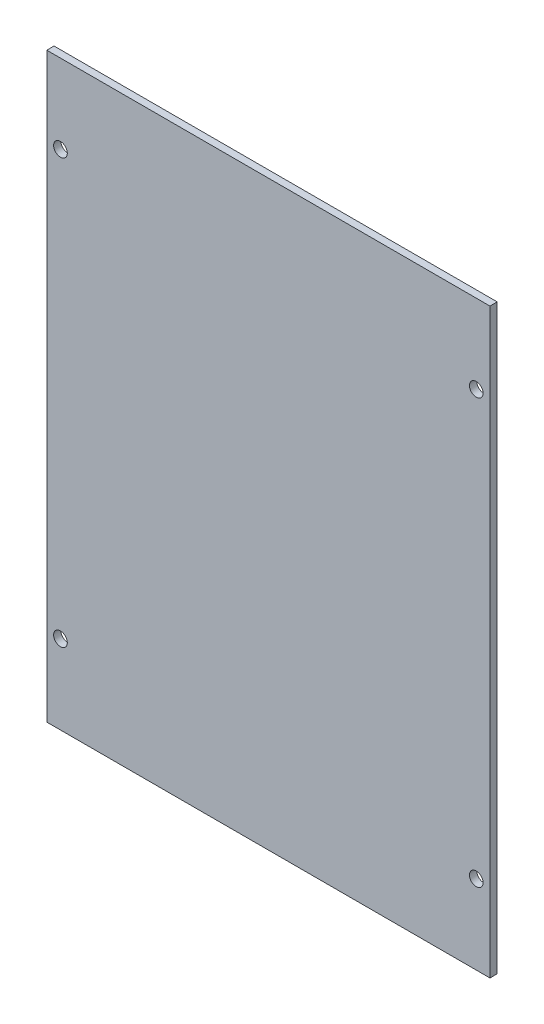
ISO-10303-21;
HEADER;
FILE_DESCRIPTION(('STEP AP214'),'2;1');
FILE_NAME('part.step','',(''),(''),'','','');
FILE_SCHEMA(('AUTOMOTIVE_DESIGN { 1 0 10303 214 1 1 1 1 }'));
ENDSEC;
DATA;
#1=APPLICATION_CONTEXT('core data for automotive mechanical design processes');
#2=APPLICATION_PROTOCOL_DEFINITION('international standard','automotive_design',2000,#1);
#3=PRODUCT_CONTEXT('',#1,'mechanical');
#4=PRODUCT('Part','Part','',(#3));
#5=PRODUCT_RELATED_PRODUCT_CATEGORY('part','',(#4));
#6=PRODUCT_DEFINITION_FORMATION('','',#4);
#7=PRODUCT_DEFINITION_CONTEXT('part definition',#1,'design');
#8=PRODUCT_DEFINITION('design','',#6,#7);
#9=PRODUCT_DEFINITION_SHAPE('','',#8);
#10=(LENGTH_UNIT() NAMED_UNIT(*) SI_UNIT(.MILLI.,.METRE.));
#11=(NAMED_UNIT(*) PLANE_ANGLE_UNIT() SI_UNIT($,.RADIAN.));
#12=(NAMED_UNIT(*) SI_UNIT($,.STERADIAN.) SOLID_ANGLE_UNIT());
#13=UNCERTAINTY_MEASURE_WITH_UNIT(LENGTH_MEASURE(1.E-05),#10,'distance_accuracy_value','');
#14=(GEOMETRIC_REPRESENTATION_CONTEXT(3) GLOBAL_UNCERTAINTY_ASSIGNED_CONTEXT((#13)) GLOBAL_UNIT_ASSIGNED_CONTEXT((#10,
#11,#12)) REPRESENTATION_CONTEXT('',''));
#15=CARTESIAN_POINT('',(0.,0.,0.));
#16=DIRECTION('',(0.,0.,1.));
#17=DIRECTION('',(1.,0.,0.));
#18=AXIS2_PLACEMENT_3D('',#15,#16,#17);
#19=CARTESIAN_POINT('',(-73.025,95.885,1.1938));
#20=DIRECTION('',(1.,0.,0.));
#21=DIRECTION('',(0.,0.,-1.));
#22=AXIS2_PLACEMENT_3D('',#19,#20,#21);
#23=PLANE('',#22);
#24=DIRECTION('',(0.,-1.,0.));
#25=VECTOR('',#24,1.);
#26=CARTESIAN_POINT('',(-73.025,95.885,-1.1938));
#27=LINE('',#26,#25);
#28=CARTESIAN_POINT('',(-73.025,95.885,-1.1938));
#29=VERTEX_POINT('',#28);
#30=CARTESIAN_POINT('',(-73.025,-95.885,-1.1938));
#31=VERTEX_POINT('',#30);
#32=EDGE_CURVE('E100',#29,#31,#27,.T.);
#33=ORIENTED_EDGE('',*,*,#32,.T.);
#34=DIRECTION('',(0.,0.,-1.));
#35=VECTOR('',#34,1.);
#36=CARTESIAN_POINT('',(-73.025,-95.885,1.1938));
#37=LINE('',#36,#35);
#38=CARTESIAN_POINT('',(-73.025,-95.885,1.1938));
#39=VERTEX_POINT('',#38);
#40=EDGE_CURVE('E11',#39,#31,#37,.T.);
#41=ORIENTED_EDGE('',*,*,#40,.F.);
#42=DIRECTION('',(0.,-1.,0.));
#43=VECTOR('',#42,1.);
#44=CARTESIAN_POINT('',(-73.025,95.885,1.1938));
#45=LINE('',#44,#43);
#46=CARTESIAN_POINT('',(-73.025,95.885,1.1938));
#47=VERTEX_POINT('',#46);
#48=EDGE_CURVE('E88',#47,#39,#45,.T.);
#49=ORIENTED_EDGE('',*,*,#48,.F.);
#50=DIRECTION('',(0.,0.,-1.));
#51=VECTOR('',#50,1.);
#52=CARTESIAN_POINT('',(-73.025,95.885,1.1938));
#53=LINE('',#52,#51);
#54=EDGE_CURVE('E96',#47,#29,#53,.T.);
#55=ORIENTED_EDGE('',*,*,#54,.T.);
#56=EDGE_LOOP('',(#33,#41,#49,#55));
#57=FACE_BOUND('',#56,.T.);
#58=ADVANCED_FACE('F37',(#57),#23,.F.);
#59=CARTESIAN_POINT('',(-73.025,-95.885,1.1938));
#60=DIRECTION('',(0.,1.,0.));
#61=DIRECTION('',(0.,0.,1.));
#62=AXIS2_PLACEMENT_3D('',#59,#60,#61);
#63=PLANE('',#62);
#64=DIRECTION('',(1.,0.,0.));
#65=VECTOR('',#64,1.);
#66=CARTESIAN_POINT('',(-73.025,-95.885,-1.1938));
#67=LINE('',#66,#65);
#68=CARTESIAN_POINT('',(73.025,-95.885,-1.1938));
#69=VERTEX_POINT('',#68);
#70=EDGE_CURVE('E92',#31,#69,#67,.T.);
#71=ORIENTED_EDGE('',*,*,#70,.T.);
#72=DIRECTION('',(0.,0.,-1.));
#73=VECTOR('',#72,1.);
#74=CARTESIAN_POINT('',(73.025,-95.885,1.1938));
#75=LINE('',#74,#73);
#76=CARTESIAN_POINT('',(73.025,-95.885,1.1938));
#77=VERTEX_POINT('',#76);
#78=EDGE_CURVE('E45',#77,#69,#75,.T.);
#79=ORIENTED_EDGE('',*,*,#78,.F.);
#80=DIRECTION('',(1.,0.,0.));
#81=VECTOR('',#80,1.);
#82=CARTESIAN_POINT('',(-73.025,-95.885,1.1938));
#83=LINE('',#82,#81);
#84=EDGE_CURVE('E83',#39,#77,#83,.T.);
#85=ORIENTED_EDGE('',*,*,#84,.F.);
#86=ORIENTED_EDGE('',*,*,#40,.T.);
#87=EDGE_LOOP('',(#71,#79,#85,#86));
#88=FACE_BOUND('',#87,.T.);
#89=ADVANCED_FACE('F91',(#88),#63,.F.);
#90=CARTESIAN_POINT('',(73.025,95.885,1.1938));
#91=DIRECTION('',(-1.,0.,0.));
#92=DIRECTION('',(0.,0.,1.));
#93=AXIS2_PLACEMENT_3D('',#90,#91,#92);
#94=PLANE('',#93);
#95=DIRECTION('',(0.,1.,0.));
#96=VECTOR('',#95,1.);
#97=CARTESIAN_POINT('',(73.025,95.885,-1.1938));
#98=LINE('',#97,#96);
#99=CARTESIAN_POINT('',(73.025,95.885,-1.1938));
#100=VERTEX_POINT('',#99);
#101=EDGE_CURVE('E70',#69,#100,#98,.T.);
#102=ORIENTED_EDGE('',*,*,#101,.T.);
#103=DIRECTION('',(0.,0.,-1.));
#104=VECTOR('',#103,1.);
#105=CARTESIAN_POINT('',(73.025,95.885,1.1938));
#106=LINE('',#105,#104);
#107=CARTESIAN_POINT('',(73.025,95.885,1.1938));
#108=VERTEX_POINT('',#107);
#109=EDGE_CURVE('E93',#108,#100,#106,.T.);
#110=ORIENTED_EDGE('',*,*,#109,.F.);
#111=DIRECTION('',(0.,1.,0.));
#112=VECTOR('',#111,1.);
#113=CARTESIAN_POINT('',(73.025,95.885,1.1938));
#114=LINE('',#113,#112);
#115=EDGE_CURVE('E86',#77,#108,#114,.T.);
#116=ORIENTED_EDGE('',*,*,#115,.F.);
#117=ORIENTED_EDGE('',*,*,#78,.T.);
#118=EDGE_LOOP('',(#102,#110,#116,#117));
#119=FACE_BOUND('',#118,.T.);
#120=ADVANCED_FACE('F94',(#119),#94,.F.);
#121=CARTESIAN_POINT('',(-73.025,95.885,1.1938));
#122=DIRECTION('',(0.,-1.,0.));
#123=DIRECTION('',(0.,0.,-1.));
#124=AXIS2_PLACEMENT_3D('',#121,#122,#123);
#125=PLANE('',#124);
#126=DIRECTION('',(-1.,0.,0.));
#127=VECTOR('',#126,1.);
#128=CARTESIAN_POINT('',(-73.025,95.885,-1.1938));
#129=LINE('',#128,#127);
#130=EDGE_CURVE('E76',#100,#29,#129,.T.);
#131=ORIENTED_EDGE('',*,*,#130,.T.);
#132=ORIENTED_EDGE('',*,*,#54,.F.);
#133=DIRECTION('',(-1.,0.,0.));
#134=VECTOR('',#133,1.);
#135=CARTESIAN_POINT('',(-73.025,95.885,1.1938));
#136=LINE('',#135,#134);
#137=EDGE_CURVE('E53',#108,#47,#136,.T.);
#138=ORIENTED_EDGE('',*,*,#137,.F.);
#139=ORIENTED_EDGE('',*,*,#109,.T.);
#140=EDGE_LOOP('',(#131,#132,#138,#139));
#141=FACE_BOUND('',#140,.T.);
#142=ADVANCED_FACE('F108',(#141),#125,.F.);
#143=CARTESIAN_POINT('',(0.,0.,1.1938));
#144=DIRECTION('',(0.,0.,1.));
#145=DIRECTION('',(1.,0.,0.));
#146=AXIS2_PLACEMENT_3D('',#143,#144,#145);
#147=PLANE('',#146);
#148=CARTESIAN_POINT('',(68.5165,69.85,1.1938));
#149=DIRECTION('',(0.,0.,1.));
#150=DIRECTION('',(1.,0.,0.));
#151=AXIS2_PLACEMENT_3D('',#148,#149,#150);
#152=CIRCLE('',#151,2.24789999999998);
#153=CARTESIAN_POINT('',(70.7644,69.85,1.1938));
#154=VERTEX_POINT('',#153);
#155=EDGE_CURVE('E134',#154,#154,#152,.T.);
#156=ORIENTED_EDGE('',*,*,#155,.F.);
#157=EDGE_LOOP('',(#156));
#158=FACE_BOUND('',#157,.T.);
#159=CARTESIAN_POINT('',(-68.5165,69.85,1.1938));
#160=DIRECTION('',(0.,0.,1.));
#161=DIRECTION('',(1.,0.,0.));
#162=AXIS2_PLACEMENT_3D('',#159,#160,#161);
#163=CIRCLE('',#162,2.24789999999998);
#164=CARTESIAN_POINT('',(-66.2686,69.85,1.1938));
#165=VERTEX_POINT('',#164);
#166=EDGE_CURVE('E128',#165,#165,#163,.T.);
#167=ORIENTED_EDGE('',*,*,#166,.F.);
#168=EDGE_LOOP('',(#167));
#169=FACE_BOUND('',#168,.T.);
#170=CARTESIAN_POINT('',(-68.5165,-69.85,1.1938));
#171=DIRECTION('',(0.,0.,1.));
#172=DIRECTION('',(1.,0.,0.));
#173=AXIS2_PLACEMENT_3D('',#170,#171,#172);
#174=CIRCLE('',#173,2.24789999999998);
#175=CARTESIAN_POINT('',(-66.2686,-69.85,1.1938));
#176=VERTEX_POINT('',#175);
#177=EDGE_CURVE('E122',#176,#176,#174,.T.);
#178=ORIENTED_EDGE('',*,*,#177,.F.);
#179=EDGE_LOOP('',(#178));
#180=FACE_BOUND('',#179,.T.);
#181=CARTESIAN_POINT('',(68.5165,-69.85,1.1938));
#182=DIRECTION('',(0.,0.,1.));
#183=DIRECTION('',(1.,0.,0.));
#184=AXIS2_PLACEMENT_3D('',#181,#182,#183);
#185=CIRCLE('',#184,2.24789999999998);
#186=CARTESIAN_POINT('',(70.7644,-69.85,1.1938));
#187=VERTEX_POINT('',#186);
#188=EDGE_CURVE('E116',#187,#187,#185,.T.);
#189=ORIENTED_EDGE('',*,*,#188,.F.);
#190=EDGE_LOOP('',(#189));
#191=FACE_BOUND('',#190,.T.);
#192=ORIENTED_EDGE('',*,*,#48,.T.);
#193=ORIENTED_EDGE('',*,*,#84,.T.);
#194=ORIENTED_EDGE('',*,*,#115,.T.);
#195=ORIENTED_EDGE('',*,*,#137,.T.);
#196=EDGE_LOOP('',(#192,#193,#194,#195));
#197=FACE_BOUND('',#196,.T.);
#198=ADVANCED_FACE('F84',(#158,#169,#180,#191,#197),#147,.T.);
#199=CARTESIAN_POINT('',(0.,0.,-1.1938));
#200=DIRECTION('',(0.,0.,1.));
#201=DIRECTION('',(1.,0.,0.));
#202=AXIS2_PLACEMENT_3D('',#199,#200,#201);
#203=PLANE('',#202);
#204=CARTESIAN_POINT('',(68.5165,69.85,-1.1938));
#205=DIRECTION('',(0.,0.,1.));
#206=DIRECTION('',(1.,0.,0.));
#207=AXIS2_PLACEMENT_3D('',#204,#205,#206);
#208=CIRCLE('',#207,2.2479);
#209=CARTESIAN_POINT('',(70.7644,69.85,-1.1938));
#210=VERTEX_POINT('',#209);
#211=EDGE_CURVE('E131',#210,#210,#208,.T.);
#212=ORIENTED_EDGE('',*,*,#211,.T.);
#213=EDGE_LOOP('',(#212));
#214=FACE_BOUND('',#213,.T.);
#215=CARTESIAN_POINT('',(-68.5165,69.85,-1.1938));
#216=DIRECTION('',(0.,0.,1.));
#217=DIRECTION('',(1.,0.,0.));
#218=AXIS2_PLACEMENT_3D('',#215,#216,#217);
#219=CIRCLE('',#218,2.2479);
#220=CARTESIAN_POINT('',(-66.2686,69.85,-1.1938));
#221=VERTEX_POINT('',#220);
#222=EDGE_CURVE('E125',#221,#221,#219,.T.);
#223=ORIENTED_EDGE('',*,*,#222,.T.);
#224=EDGE_LOOP('',(#223));
#225=FACE_BOUND('',#224,.T.);
#226=CARTESIAN_POINT('',(-68.5165,-69.85,-1.1938));
#227=DIRECTION('',(0.,0.,1.));
#228=DIRECTION('',(1.,0.,0.));
#229=AXIS2_PLACEMENT_3D('',#226,#227,#228);
#230=CIRCLE('',#229,2.2479);
#231=CARTESIAN_POINT('',(-66.2686,-69.85,-1.1938));
#232=VERTEX_POINT('',#231);
#233=EDGE_CURVE('E119',#232,#232,#230,.T.);
#234=ORIENTED_EDGE('',*,*,#233,.T.);
#235=EDGE_LOOP('',(#234));
#236=FACE_BOUND('',#235,.T.);
#237=CARTESIAN_POINT('',(68.5165,-69.85,-1.1938));
#238=DIRECTION('',(0.,0.,1.));
#239=DIRECTION('',(1.,0.,0.));
#240=AXIS2_PLACEMENT_3D('',#237,#238,#239);
#241=CIRCLE('',#240,2.2479);
#242=CARTESIAN_POINT('',(70.7644,-69.85,-1.1938));
#243=VERTEX_POINT('',#242);
#244=EDGE_CURVE('E103',#243,#243,#241,.T.);
#245=ORIENTED_EDGE('',*,*,#244,.T.);
#246=EDGE_LOOP('',(#245));
#247=FACE_BOUND('',#246,.T.);
#248=ORIENTED_EDGE('',*,*,#32,.F.);
#249=ORIENTED_EDGE('',*,*,#130,.F.);
#250=ORIENTED_EDGE('',*,*,#101,.F.);
#251=ORIENTED_EDGE('',*,*,#70,.F.);
#252=EDGE_LOOP('',(#248,#249,#250,#251));
#253=FACE_BOUND('',#252,.T.);
#254=ADVANCED_FACE('F111',(#214,#225,#236,#247,#253),#203,.F.);
#255=CARTESIAN_POINT('',(68.5165,-69.85,1.1938));
#256=DIRECTION('',(0.,0.,1.));
#257=DIRECTION('',(1.,0.,0.));
#258=AXIS2_PLACEMENT_3D('',#255,#256,#257);
#259=CYLINDRICAL_SURFACE('',#258,2.24789999999999);
#260=ORIENTED_EDGE('',*,*,#244,.F.);
#261=EDGE_LOOP('',(#260));
#262=FACE_BOUND('',#261,.T.);
#263=ORIENTED_EDGE('',*,*,#188,.T.);
#264=EDGE_LOOP('',(#263));
#265=FACE_BOUND('',#264,.T.);
#266=ADVANCED_FACE('F149',(#262,#265),#259,.F.);
#267=CARTESIAN_POINT('',(-68.5165,-69.85,1.1938));
#268=DIRECTION('',(0.,0.,1.));
#269=DIRECTION('',(1.,0.,0.));
#270=AXIS2_PLACEMENT_3D('',#267,#268,#269);
#271=CYLINDRICAL_SURFACE('',#270,2.24789999999999);
#272=ORIENTED_EDGE('',*,*,#233,.F.);
#273=EDGE_LOOP('',(#272));
#274=FACE_BOUND('',#273,.T.);
#275=ORIENTED_EDGE('',*,*,#177,.T.);
#276=EDGE_LOOP('',(#275));
#277=FACE_BOUND('',#276,.T.);
#278=ADVANCED_FACE('F151',(#274,#277),#271,.F.);
#279=CARTESIAN_POINT('',(-68.5165,69.85,1.1938));
#280=DIRECTION('',(0.,0.,1.));
#281=DIRECTION('',(1.,0.,0.));
#282=AXIS2_PLACEMENT_3D('',#279,#280,#281);
#283=CYLINDRICAL_SURFACE('',#282,2.24789999999999);
#284=ORIENTED_EDGE('',*,*,#222,.F.);
#285=EDGE_LOOP('',(#284));
#286=FACE_BOUND('',#285,.T.);
#287=ORIENTED_EDGE('',*,*,#166,.T.);
#288=EDGE_LOOP('',(#287));
#289=FACE_BOUND('',#288,.T.);
#290=ADVANCED_FACE('F158',(#286,#289),#283,.F.);
#291=CARTESIAN_POINT('',(68.5165,69.85,1.1938));
#292=DIRECTION('',(0.,0.,1.));
#293=DIRECTION('',(1.,0.,0.));
#294=AXIS2_PLACEMENT_3D('',#291,#292,#293);
#295=CYLINDRICAL_SURFACE('',#294,2.24789999999999);
#296=ORIENTED_EDGE('',*,*,#211,.F.);
#297=EDGE_LOOP('',(#296));
#298=FACE_BOUND('',#297,.T.);
#299=ORIENTED_EDGE('',*,*,#155,.T.);
#300=EDGE_LOOP('',(#299));
#301=FACE_BOUND('',#300,.T.);
#302=ADVANCED_FACE('F138',(#298,#301),#295,.F.);
#303=CLOSED_SHELL('',(#58,#89,#120,#142,#198,#254,#266,#278,#290,#302));
#304=MANIFOLD_SOLID_BREP('B2',#303);
#305=ADVANCED_BREP_SHAPE_REPRESENTATION('',(#18,#304),#14);
#306=SHAPE_DEFINITION_REPRESENTATION(#9,#305);
ENDSEC;
END-ISO-10303-21;
